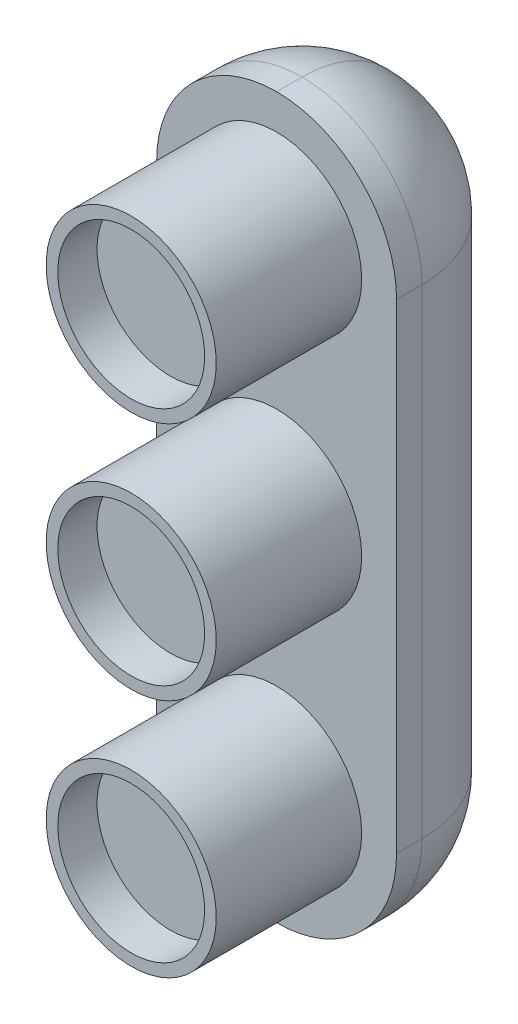
ISO-10303-21;
HEADER;
FILE_DESCRIPTION(('STEP AP214'),'2;1');
FILE_NAME('part.step','',(''),(''),'','','');
FILE_SCHEMA(('AUTOMOTIVE_DESIGN { 1 0 10303 214 1 1 1 1 }'));
ENDSEC;
DATA;
#1=APPLICATION_CONTEXT('core data for automotive mechanical design processes');
#2=APPLICATION_PROTOCOL_DEFINITION('international standard','automotive_design',2000,#1);
#3=PRODUCT_CONTEXT('',#1,'mechanical');
#4=PRODUCT('Part','Part','',(#3));
#5=PRODUCT_RELATED_PRODUCT_CATEGORY('part','',(#4));
#6=PRODUCT_DEFINITION_FORMATION('','',#4);
#7=PRODUCT_DEFINITION_CONTEXT('part definition',#1,'design');
#8=PRODUCT_DEFINITION('design','',#6,#7);
#9=PRODUCT_DEFINITION_SHAPE('','',#8);
#10=(LENGTH_UNIT() NAMED_UNIT(*) SI_UNIT(.MILLI.,.METRE.));
#11=(NAMED_UNIT(*) PLANE_ANGLE_UNIT() SI_UNIT($,.RADIAN.));
#12=(NAMED_UNIT(*) SI_UNIT($,.STERADIAN.) SOLID_ANGLE_UNIT());
#13=UNCERTAINTY_MEASURE_WITH_UNIT(LENGTH_MEASURE(1.E-05),#10,'distance_accuracy_value','');
#14=(GEOMETRIC_REPRESENTATION_CONTEXT(3) GLOBAL_UNCERTAINTY_ASSIGNED_CONTEXT((#13)) GLOBAL_UNIT_ASSIGNED_CONTEXT((#10,
#11,#12)) REPRESENTATION_CONTEXT('',''));
#15=CARTESIAN_POINT('',(0.,0.,0.));
#16=DIRECTION('',(0.,0.,1.));
#17=DIRECTION('',(1.,0.,0.));
#18=AXIS2_PLACEMENT_3D('',#15,#16,#17);
#19=CARTESIAN_POINT('',(-65.9999999999999,165.,20.));
#20=DIRECTION('',(1.,0.,0.));
#21=DIRECTION('',(0.,1.,0.));
#22=AXIS2_PLACEMENT_3D('',#19,#20,#21);
#23=PLANE('',#22);
#24=DIRECTION('',(0.,-1.,0.));
#25=VECTOR('',#24,1.);
#26=CARTESIAN_POINT('',(-65.9999999999999,165.,8.25));
#27=LINE('',#26,#25);
#28=CARTESIAN_POINT('',(-65.9999999999999,156.75,8.25));
#29=VERTEX_POINT('',#28);
#30=CARTESIAN_POINT('',(-65.9999999999999,123.75,8.25));
#31=VERTEX_POINT('',#30);
#32=EDGE_CURVE('E311',#29,#31,#27,.T.);
#33=ORIENTED_EDGE('',*,*,#32,.T.);
#34=DIRECTION('',(0.,0.,-1.));
#35=VECTOR('',#34,1.);
#36=CARTESIAN_POINT('',(-65.9999999999999,123.75,20.));
#37=LINE('',#36,#35);
#38=CARTESIAN_POINT('',(-65.9999999999999,123.75,10.));
#39=VERTEX_POINT('',#38);
#40=EDGE_CURVE('E184',#31,#39,#37,.F.);
#41=ORIENTED_EDGE('',*,*,#40,.T.);
#42=DIRECTION('',(0.,-1.,0.));
#43=VECTOR('',#42,1.);
#44=CARTESIAN_POINT('',(-66.,0.,10.));
#45=LINE('',#44,#43);
#46=CARTESIAN_POINT('',(-65.9999999999999,156.75,10.));
#47=VERTEX_POINT('',#46);
#48=EDGE_CURVE('E323',#47,#39,#45,.T.);
#49=ORIENTED_EDGE('',*,*,#48,.F.);
#50=DIRECTION('',(0.,0.,-1.));
#51=VECTOR('',#50,1.);
#52=CARTESIAN_POINT('',(-65.9999999999999,156.75,20.));
#53=LINE('',#52,#51);
#54=EDGE_CURVE('E309',#47,#29,#53,.T.);
#55=ORIENTED_EDGE('',*,*,#54,.T.);
#56=EDGE_LOOP('',(#33,#41,#49,#55));
#57=FACE_BOUND('',#56,.T.);
#58=ADVANCED_FACE('F84',(#57),#23,.F.);
#59=CARTESIAN_POINT('',(-49.5,165.,20.));
#60=DIRECTION('',(-1.,0.,0.));
#61=DIRECTION('',(0.,-1.,0.));
#62=AXIS2_PLACEMENT_3D('',#59,#60,#61);
#63=PLANE('',#62);
#64=DIRECTION('',(0.,1.,0.));
#65=VECTOR('',#64,1.);
#66=CARTESIAN_POINT('',(-49.4999999999999,0.,10.));
#67=LINE('',#66,#65);
#68=CARTESIAN_POINT('',(-49.5,123.75,10.));
#69=VERTEX_POINT('',#68);
#70=CARTESIAN_POINT('',(-49.5,156.75,10.));
#71=VERTEX_POINT('',#70);
#72=EDGE_CURVE('E161',#69,#71,#67,.T.);
#73=ORIENTED_EDGE('',*,*,#72,.F.);
#74=DIRECTION('',(0.,0.,-1.));
#75=VECTOR('',#74,1.);
#76=CARTESIAN_POINT('',(-49.4999999999999,123.75,20.));
#77=LINE('',#76,#75);
#78=CARTESIAN_POINT('',(-49.4999999999999,123.75,8.25));
#79=VERTEX_POINT('',#78);
#80=EDGE_CURVE('E156',#69,#79,#77,.T.);
#81=ORIENTED_EDGE('',*,*,#80,.T.);
#82=DIRECTION('',(0.,1.,0.));
#83=VECTOR('',#82,1.);
#84=CARTESIAN_POINT('',(-49.5,165.,8.25));
#85=LINE('',#84,#83);
#86=CARTESIAN_POINT('',(-49.5,156.75,8.25));
#87=VERTEX_POINT('',#86);
#88=EDGE_CURVE('E159',#79,#87,#85,.T.);
#89=ORIENTED_EDGE('',*,*,#88,.T.);
#90=DIRECTION('',(0.,0.,-1.));
#91=VECTOR('',#90,1.);
#92=CARTESIAN_POINT('',(-49.5,156.75,20.));
#93=LINE('',#92,#91);
#94=EDGE_CURVE('E181',#87,#71,#93,.F.);
#95=ORIENTED_EDGE('',*,*,#94,.T.);
#96=EDGE_LOOP('',(#73,#81,#89,#95));
#97=FACE_BOUND('',#96,.T.);
#98=ADVANCED_FACE('F157',(#97),#63,.F.);
#99=CARTESIAN_POINT('',(-57.7499999999999,156.75,10.));
#100=DIRECTION('',(0.,0.,1.));
#101=DIRECTION('',(1.,0.,0.));
#102=AXIS2_PLACEMENT_3D('',#99,#100,#101);
#103=CYLINDRICAL_SURFACE('',#102,5.85);
#104=CARTESIAN_POINT('',(-57.7499999999999,156.75,10.));
#105=DIRECTION('',(0.,0.,1.));
#106=DIRECTION('',(1.,0.,0.));
#107=AXIS2_PLACEMENT_3D('',#104,#105,#106);
#108=CIRCLE('',#107,5.85);
#109=CARTESIAN_POINT('',(-51.8999999999999,156.75,10.));
#110=VERTEX_POINT('',#109);
#111=EDGE_CURVE('E327',#110,#110,#108,.T.);
#112=ORIENTED_EDGE('',*,*,#111,.T.);
#113=EDGE_LOOP('',(#112));
#114=FACE_BOUND('',#113,.T.);
#115=CARTESIAN_POINT('',(-57.7499999999999,156.75,20.));
#116=DIRECTION('',(0.,0.,1.));
#117=DIRECTION('',(1.,0.,0.));
#118=AXIS2_PLACEMENT_3D('',#115,#116,#117);
#119=CIRCLE('',#118,5.85);
#120=CARTESIAN_POINT('',(-51.8999999999999,156.75,20.));
#121=VERTEX_POINT('',#120);
#122=EDGE_CURVE('E340',#121,#121,#119,.T.);
#123=ORIENTED_EDGE('',*,*,#122,.F.);
#124=EDGE_LOOP('',(#123));
#125=FACE_BOUND('',#124,.T.);
#126=ADVANCED_FACE('F262',(#114,#125),#103,.T.);
#127=CARTESIAN_POINT('',(-57.7499999999999,140.25,10.));
#128=DIRECTION('',(0.,0.,1.));
#129=DIRECTION('',(1.,0.,0.));
#130=AXIS2_PLACEMENT_3D('',#127,#128,#129);
#131=CYLINDRICAL_SURFACE('',#130,5.85);
#132=CARTESIAN_POINT('',(-57.7499999999999,140.25,10.));
#133=DIRECTION('',(0.,0.,1.));
#134=DIRECTION('',(1.,0.,0.));
#135=AXIS2_PLACEMENT_3D('',#132,#133,#134);
#136=CIRCLE('',#135,5.85);
#137=CARTESIAN_POINT('',(-51.8999999999999,140.25,10.));
#138=VERTEX_POINT('',#137);
#139=EDGE_CURVE('E333',#138,#138,#136,.T.);
#140=ORIENTED_EDGE('',*,*,#139,.T.);
#141=EDGE_LOOP('',(#140));
#142=FACE_BOUND('',#141,.T.);
#143=CARTESIAN_POINT('',(-57.7499999999999,140.25,20.));
#144=DIRECTION('',(0.,0.,1.));
#145=DIRECTION('',(1.,0.,0.));
#146=AXIS2_PLACEMENT_3D('',#143,#144,#145);
#147=CIRCLE('',#146,5.85);
#148=CARTESIAN_POINT('',(-51.8999999999999,140.25,20.));
#149=VERTEX_POINT('',#148);
#150=EDGE_CURVE('E337',#149,#149,#147,.T.);
#151=ORIENTED_EDGE('',*,*,#150,.F.);
#152=EDGE_LOOP('',(#151));
#153=FACE_BOUND('',#152,.T.);
#154=ADVANCED_FACE('F401',(#142,#153),#131,.T.);
#155=CARTESIAN_POINT('',(-57.7499999999999,123.75,10.));
#156=DIRECTION('',(0.,0.,1.));
#157=DIRECTION('',(1.,0.,0.));
#158=AXIS2_PLACEMENT_3D('',#155,#156,#157);
#159=CYLINDRICAL_SURFACE('',#158,5.85);
#160=CARTESIAN_POINT('',(-57.7499999999999,123.75,10.));
#161=DIRECTION('',(0.,0.,1.));
#162=DIRECTION('',(1.,0.,0.));
#163=AXIS2_PLACEMENT_3D('',#160,#161,#162);
#164=CIRCLE('',#163,5.85);
#165=CARTESIAN_POINT('',(-51.8999999999999,123.75,10.));
#166=VERTEX_POINT('',#165);
#167=EDGE_CURVE('E312',#166,#166,#164,.F.);
#168=ORIENTED_EDGE('',*,*,#167,.F.);
#169=EDGE_LOOP('',(#168));
#170=FACE_BOUND('',#169,.T.);
#171=CARTESIAN_POINT('',(-57.7499999999999,123.75,20.));
#172=DIRECTION('',(0.,0.,1.));
#173=DIRECTION('',(1.,0.,0.));
#174=AXIS2_PLACEMENT_3D('',#171,#172,#173);
#175=CIRCLE('',#174,5.85);
#176=CARTESIAN_POINT('',(-51.8999999999999,123.75,20.));
#177=VERTEX_POINT('',#176);
#178=EDGE_CURVE('E320',#177,#177,#175,.F.);
#179=ORIENTED_EDGE('',*,*,#178,.T.);
#180=EDGE_LOOP('',(#179));
#181=FACE_BOUND('',#180,.T.);
#182=ADVANCED_FACE('F397',(#170,#181),#159,.T.);
#183=CARTESIAN_POINT('',(0.,0.,10.));
#184=DIRECTION('',(0.,0.,1.));
#185=DIRECTION('',(1.,0.,0.));
#186=AXIS2_PLACEMENT_3D('',#183,#184,#185);
#187=PLANE('',#186);
#188=ORIENTED_EDGE('',*,*,#139,.F.);
#189=EDGE_LOOP('',(#188));
#190=FACE_BOUND('',#189,.T.);
#191=ORIENTED_EDGE('',*,*,#111,.F.);
#192=EDGE_LOOP('',(#191));
#193=FACE_BOUND('',#192,.T.);
#194=ORIENTED_EDGE('',*,*,#48,.T.);
#195=CARTESIAN_POINT('',(-57.75,123.75,10.));
#196=DIRECTION('',(0.,0.,1.));
#197=DIRECTION('',(1.,0.,0.));
#198=AXIS2_PLACEMENT_3D('',#195,#196,#197);
#199=CIRCLE('',#198,8.25);
#200=CARTESIAN_POINT('',(-57.75,115.5,10.));
#201=VERTEX_POINT('',#200);
#202=EDGE_CURVE('E94',#39,#201,#199,.T.);
#203=ORIENTED_EDGE('',*,*,#202,.T.);
#204=CARTESIAN_POINT('',(-57.7499999999999,123.75,10.));
#205=DIRECTION('',(0.,0.,1.));
#206=DIRECTION('',(1.,0.,0.));
#207=AXIS2_PLACEMENT_3D('',#204,#205,#206);
#208=CIRCLE('',#207,8.25);
#209=EDGE_CURVE('E192',#201,#69,#208,.T.);
#210=ORIENTED_EDGE('',*,*,#209,.T.);
#211=ORIENTED_EDGE('',*,*,#72,.T.);
#212=CARTESIAN_POINT('',(-57.75,156.75,10.));
#213=DIRECTION('',(0.,0.,1.));
#214=DIRECTION('',(1.,0.,0.));
#215=AXIS2_PLACEMENT_3D('',#212,#213,#214);
#216=CIRCLE('',#215,8.25);
#217=CARTESIAN_POINT('',(-57.7499999999999,165.,10.));
#218=VERTEX_POINT('',#217);
#219=EDGE_CURVE('E102',#71,#218,#216,.T.);
#220=ORIENTED_EDGE('',*,*,#219,.T.);
#221=CARTESIAN_POINT('',(-57.7499999999999,156.75,10.));
#222=DIRECTION('',(0.,0.,1.));
#223=DIRECTION('',(1.,0.,0.));
#224=AXIS2_PLACEMENT_3D('',#221,#222,#223);
#225=CIRCLE('',#224,8.25);
#226=EDGE_CURVE('E133',#218,#47,#225,.T.);
#227=ORIENTED_EDGE('',*,*,#226,.T.);
#228=EDGE_LOOP('',(#194,#203,#210,#211,#220,#227));
#229=FACE_BOUND('',#228,.T.);
#230=ORIENTED_EDGE('',*,*,#167,.T.);
#231=EDGE_LOOP('',(#230));
#232=FACE_BOUND('',#231,.T.);
#233=ADVANCED_FACE('F324',(#190,#193,#229,#232),#187,.T.);
#234=CARTESIAN_POINT('',(0.,0.,20.));
#235=DIRECTION('',(0.,0.,1.));
#236=DIRECTION('',(1.,0.,0.));
#237=AXIS2_PLACEMENT_3D('',#234,#235,#236);
#238=PLANE('',#237);
#239=ORIENTED_EDGE('',*,*,#150,.T.);
#240=EDGE_LOOP('',(#239));
#241=FACE_BOUND('',#240,.T.);
#242=CARTESIAN_POINT('',(-57.7499999999999,140.25,20.));
#243=DIRECTION('',(0.,0.,1.));
#244=DIRECTION('',(1.,0.,0.));
#245=AXIS2_PLACEMENT_3D('',#242,#243,#244);
#246=CIRCLE('',#245,5.05);
#247=CARTESIAN_POINT('',(-52.6999999999999,140.25,20.));
#248=VERTEX_POINT('',#247);
#249=EDGE_CURVE('E358',#248,#248,#246,.T.);
#250=ORIENTED_EDGE('',*,*,#249,.F.);
#251=EDGE_LOOP('',(#250));
#252=FACE_BOUND('',#251,.T.);
#253=ADVANCED_FACE('F370',(#241,#252),#238,.T.);
#254=ORIENTED_EDGE('',*,*,#122,.T.);
#255=EDGE_LOOP('',(#254));
#256=FACE_BOUND('',#255,.T.);
#257=CARTESIAN_POINT('',(-57.7499999999999,156.75,20.));
#258=DIRECTION('',(0.,0.,1.));
#259=DIRECTION('',(1.,0.,0.));
#260=AXIS2_PLACEMENT_3D('',#257,#258,#259);
#261=CIRCLE('',#260,5.05);
#262=CARTESIAN_POINT('',(-52.6999999999999,156.75,20.));
#263=VERTEX_POINT('',#262);
#264=EDGE_CURVE('E341',#263,#263,#261,.T.);
#265=ORIENTED_EDGE('',*,*,#264,.F.);
#266=EDGE_LOOP('',(#265));
#267=FACE_BOUND('',#266,.T.);
#268=ADVANCED_FACE('F368',(#256,#267),#238,.T.);
#269=CARTESIAN_POINT('',(-57.7499999999999,156.75,10.));
#270=DIRECTION('',(0.,0.,1.));
#271=DIRECTION('',(1.,0.,0.));
#272=AXIS2_PLACEMENT_3D('',#269,#270,#271);
#273=CYLINDRICAL_SURFACE('',#272,5.05);
#274=CARTESIAN_POINT('',(-57.7499999999999,156.75,17.3));
#275=DIRECTION('',(0.,0.,1.));
#276=DIRECTION('',(1.,0.,0.));
#277=AXIS2_PLACEMENT_3D('',#274,#275,#276);
#278=CIRCLE('',#277,5.05);
#279=CARTESIAN_POINT('',(-52.6999999999999,156.75,17.3));
#280=VERTEX_POINT('',#279);
#281=EDGE_CURVE('E202',#280,#280,#278,.F.);
#282=ORIENTED_EDGE('',*,*,#281,.T.);
#283=EDGE_LOOP('',(#282));
#284=FACE_BOUND('',#283,.T.);
#285=ORIENTED_EDGE('',*,*,#264,.T.);
#286=EDGE_LOOP('',(#285));
#287=FACE_BOUND('',#286,.T.);
#288=ADVANCED_FACE('F366',(#284,#287),#273,.F.);
#289=CARTESIAN_POINT('',(-57.7499999999999,140.25,10.));
#290=DIRECTION('',(0.,0.,1.));
#291=DIRECTION('',(1.,0.,0.));
#292=AXIS2_PLACEMENT_3D('',#289,#290,#291);
#293=CYLINDRICAL_SURFACE('',#292,5.05);
#294=CARTESIAN_POINT('',(-57.7499999999999,140.25,17.3));
#295=DIRECTION('',(0.,0.,1.));
#296=DIRECTION('',(1.,0.,0.));
#297=AXIS2_PLACEMENT_3D('',#294,#295,#296);
#298=CIRCLE('',#297,5.05);
#299=CARTESIAN_POINT('',(-52.6999999999999,140.25,17.3));
#300=VERTEX_POINT('',#299);
#301=EDGE_CURVE('E234',#300,#300,#298,.F.);
#302=ORIENTED_EDGE('',*,*,#301,.T.);
#303=EDGE_LOOP('',(#302));
#304=FACE_BOUND('',#303,.T.);
#305=ORIENTED_EDGE('',*,*,#249,.T.);
#306=EDGE_LOOP('',(#305));
#307=FACE_BOUND('',#306,.T.);
#308=ADVANCED_FACE('F239',(#304,#307),#293,.F.);
#309=CARTESIAN_POINT('',(-57.7499999999999,123.75,20.));
#310=DIRECTION('',(0.,0.,1.));
#311=DIRECTION('',(1.,0.,0.));
#312=AXIS2_PLACEMENT_3D('',#309,#310,#311);
#313=CIRCLE('',#312,5.05);
#314=CARTESIAN_POINT('',(-52.6999999999999,123.75,20.));
#315=VERTEX_POINT('',#314);
#316=EDGE_CURVE('E231',#315,#315,#313,.F.);
#317=ORIENTED_EDGE('',*,*,#316,.T.);
#318=EDGE_LOOP('',(#317));
#319=FACE_BOUND('',#318,.T.);
#320=ORIENTED_EDGE('',*,*,#178,.F.);
#321=EDGE_LOOP('',(#320));
#322=FACE_BOUND('',#321,.T.);
#323=ADVANCED_FACE('F371',(#319,#322),#238,.T.);
#324=CARTESIAN_POINT('',(-57.7499999999999,123.75,10.));
#325=DIRECTION('',(0.,0.,1.));
#326=DIRECTION('',(1.,0.,0.));
#327=AXIS2_PLACEMENT_3D('',#324,#325,#326);
#328=CYLINDRICAL_SURFACE('',#327,5.05);
#329=CARTESIAN_POINT('',(-57.7499999999999,123.75,17.3));
#330=DIRECTION('',(0.,0.,1.));
#331=DIRECTION('',(1.,0.,0.));
#332=AXIS2_PLACEMENT_3D('',#329,#330,#331);
#333=CIRCLE('',#332,5.05);
#334=CARTESIAN_POINT('',(-52.6999999999999,123.75,17.3));
#335=VERTEX_POINT('',#334);
#336=EDGE_CURVE('E12',#335,#335,#333,.T.);
#337=ORIENTED_EDGE('',*,*,#336,.F.);
#338=EDGE_LOOP('',(#337));
#339=FACE_BOUND('',#338,.T.);
#340=ORIENTED_EDGE('',*,*,#316,.F.);
#341=EDGE_LOOP('',(#340));
#342=FACE_BOUND('',#341,.T.);
#343=ADVANCED_FACE('F299',(#339,#342),#328,.F.);
#344=CARTESIAN_POINT('',(-57.7499999999999,123.75,20.));
#345=DIRECTION('',(0.,0.,-1.));
#346=DIRECTION('',(-1.,0.,0.));
#347=AXIS2_PLACEMENT_3D('',#344,#345,#346);
#348=CYLINDRICAL_SURFACE('',#347,8.25);
#349=ORIENTED_EDGE('',*,*,#80,.F.);
#350=ORIENTED_EDGE('',*,*,#209,.F.);
#351=DIRECTION('',(0.,0.,-1.));
#352=VECTOR('',#351,1.);
#353=CARTESIAN_POINT('',(-57.75,115.5,20.));
#354=LINE('',#353,#352);
#355=CARTESIAN_POINT('',(-57.75,115.5,8.25));
#356=VERTEX_POINT('',#355);
#357=EDGE_CURVE('E128',#356,#201,#354,.F.);
#358=ORIENTED_EDGE('',*,*,#357,.F.);
#359=CARTESIAN_POINT('',(-57.7499999999999,123.75,8.25));
#360=DIRECTION('',(0.,0.,-1.));
#361=DIRECTION('',(-1.,0.,0.));
#362=AXIS2_PLACEMENT_3D('',#359,#360,#361);
#363=CIRCLE('',#362,8.25);
#364=EDGE_CURVE('E164',#79,#356,#363,.T.);
#365=ORIENTED_EDGE('',*,*,#364,.F.);
#366=EDGE_LOOP('',(#349,#350,#358,#365));
#367=FACE_BOUND('',#366,.T.);
#368=ADVANCED_FACE('F86',(#367),#348,.T.);
#369=CARTESIAN_POINT('',(-57.75,123.75,20.));
#370=DIRECTION('',(0.,0.,-1.));
#371=DIRECTION('',(-1.,0.,0.));
#372=AXIS2_PLACEMENT_3D('',#369,#370,#371);
#373=CYLINDRICAL_SURFACE('',#372,8.25);
#374=CARTESIAN_POINT('',(-57.75,123.75,8.25));
#375=DIRECTION('',(0.,0.,-1.));
#376=DIRECTION('',(-1.,0.,0.));
#377=AXIS2_PLACEMENT_3D('',#374,#375,#376);
#378=CIRCLE('',#377,8.25);
#379=EDGE_CURVE('E166',#356,#31,#378,.T.);
#380=ORIENTED_EDGE('',*,*,#379,.F.);
#381=ORIENTED_EDGE('',*,*,#357,.T.);
#382=ORIENTED_EDGE('',*,*,#202,.F.);
#383=ORIENTED_EDGE('',*,*,#40,.F.);
#384=EDGE_LOOP('',(#380,#381,#382,#383));
#385=FACE_BOUND('',#384,.T.);
#386=ADVANCED_FACE('F293',(#385),#373,.T.);
#387=CARTESIAN_POINT('',(-57.7499999999999,123.75,8.25));
#388=DIRECTION('',(0.,-1.,0.));
#389=DIRECTION('',(1.,0.,0.));
#390=AXIS2_PLACEMENT_3D('',#387,#388,#389);
#391=SPHERICAL_SURFACE('',#390,8.25);
#392=ORIENTED_EDGE('',*,*,#364,.T.);
#393=CARTESIAN_POINT('',(-57.75,123.75,8.25));
#394=DIRECTION('',(-1.,0.,0.));
#395=DIRECTION('',(0.,-1.,0.));
#396=AXIS2_PLACEMENT_3D('',#393,#394,#395);
#397=CIRCLE('',#396,8.25);
#398=CARTESIAN_POINT('',(-57.75,123.75,0.));
#399=VERTEX_POINT('',#398);
#400=EDGE_CURVE('E120',#399,#356,#397,.T.);
#401=ORIENTED_EDGE('',*,*,#400,.F.);
#402=CARTESIAN_POINT('',(-57.7499999999999,123.75,8.25));
#403=DIRECTION('',(0.,-1.,0.));
#404=DIRECTION('',(0.,0.,-1.));
#405=AXIS2_PLACEMENT_3D('',#402,#403,#404);
#406=CIRCLE('',#405,8.25);
#407=EDGE_CURVE('E168',#79,#399,#406,.F.);
#408=ORIENTED_EDGE('',*,*,#407,.F.);
#409=EDGE_LOOP('',(#392,#401,#408));
#410=FACE_BOUND('',#409,.T.);
#411=ADVANCED_FACE('F169',(#410),#391,.T.);
#412=CARTESIAN_POINT('',(-57.75,123.75,8.25));
#413=DIRECTION('',(0.,-1.,0.));
#414=DIRECTION('',(1.,0.,0.));
#415=AXIS2_PLACEMENT_3D('',#412,#413,#414);
#416=SPHERICAL_SURFACE('',#415,8.25);
#417=ORIENTED_EDGE('',*,*,#400,.T.);
#418=ORIENTED_EDGE('',*,*,#379,.T.);
#419=CARTESIAN_POINT('',(-57.75,123.75,8.25));
#420=DIRECTION('',(0.,-1.,0.));
#421=DIRECTION('',(0.,0.,-1.));
#422=AXIS2_PLACEMENT_3D('',#419,#420,#421);
#423=CIRCLE('',#422,8.25);
#424=EDGE_CURVE('E219',#399,#31,#423,.F.);
#425=ORIENTED_EDGE('',*,*,#424,.F.);
#426=EDGE_LOOP('',(#417,#418,#425));
#427=FACE_BOUND('',#426,.T.);
#428=ADVANCED_FACE('F288',(#427),#416,.T.);
#429=CARTESIAN_POINT('',(-57.75,165.,8.25));
#430=DIRECTION('',(0.,1.,0.));
#431=DIRECTION('',(-1.,0.,0.));
#432=AXIS2_PLACEMENT_3D('',#429,#430,#431);
#433=CYLINDRICAL_SURFACE('',#432,8.25);
#434=ORIENTED_EDGE('',*,*,#88,.F.);
#435=ORIENTED_EDGE('',*,*,#407,.T.);
#436=DIRECTION('',(0.,1.,0.));
#437=VECTOR('',#436,1.);
#438=CARTESIAN_POINT('',(-57.7499999999999,0.,0.));
#439=LINE('',#438,#437);
#440=CARTESIAN_POINT('',(-57.75,156.75,0.));
#441=VERTEX_POINT('',#440);
#442=EDGE_CURVE('E215',#441,#399,#439,.F.);
#443=ORIENTED_EDGE('',*,*,#442,.F.);
#444=CARTESIAN_POINT('',(-57.75,156.75,8.25));
#445=DIRECTION('',(0.,1.,0.));
#446=DIRECTION('',(0.,0.,1.));
#447=AXIS2_PLACEMENT_3D('',#444,#445,#446);
#448=CIRCLE('',#447,8.25);
#449=EDGE_CURVE('E178',#87,#441,#448,.T.);
#450=ORIENTED_EDGE('',*,*,#449,.F.);
#451=EDGE_LOOP('',(#434,#435,#443,#450));
#452=FACE_BOUND('',#451,.T.);
#453=ADVANCED_FACE('F176',(#452),#433,.T.);
#454=CARTESIAN_POINT('',(-57.75,156.75,20.));
#455=DIRECTION('',(0.,0.,-1.));
#456=DIRECTION('',(-1.,0.,0.));
#457=AXIS2_PLACEMENT_3D('',#454,#455,#456);
#458=CYLINDRICAL_SURFACE('',#457,8.25);
#459=DIRECTION('',(0.,0.,-1.));
#460=VECTOR('',#459,1.);
#461=CARTESIAN_POINT('',(-57.7499999999999,165.,20.));
#462=LINE('',#461,#460);
#463=CARTESIAN_POINT('',(-57.7499999999999,165.,8.25));
#464=VERTEX_POINT('',#463);
#465=EDGE_CURVE('E173',#218,#464,#462,.T.);
#466=ORIENTED_EDGE('',*,*,#465,.F.);
#467=ORIENTED_EDGE('',*,*,#219,.F.);
#468=ORIENTED_EDGE('',*,*,#94,.F.);
#469=CARTESIAN_POINT('',(-57.75,156.75,8.25));
#470=DIRECTION('',(0.,0.,-1.));
#471=DIRECTION('',(-1.,0.,0.));
#472=AXIS2_PLACEMENT_3D('',#469,#470,#471);
#473=CIRCLE('',#472,8.25);
#474=EDGE_CURVE('E210',#464,#87,#473,.T.);
#475=ORIENTED_EDGE('',*,*,#474,.F.);
#476=EDGE_LOOP('',(#466,#467,#468,#475));
#477=FACE_BOUND('',#476,.T.);
#478=ADVANCED_FACE('F281',(#477),#458,.T.);
#479=CARTESIAN_POINT('',(-57.7499999999999,156.75,20.));
#480=DIRECTION('',(0.,0.,-1.));
#481=DIRECTION('',(-1.,0.,0.));
#482=AXIS2_PLACEMENT_3D('',#479,#480,#481);
#483=CYLINDRICAL_SURFACE('',#482,8.25);
#484=ORIENTED_EDGE('',*,*,#226,.F.);
#485=ORIENTED_EDGE('',*,*,#465,.T.);
#486=CARTESIAN_POINT('',(-57.7499999999999,156.75,8.25));
#487=DIRECTION('',(0.,0.,-1.));
#488=DIRECTION('',(-1.,0.,0.));
#489=AXIS2_PLACEMENT_3D('',#486,#487,#488);
#490=CIRCLE('',#489,8.25);
#491=EDGE_CURVE('E206',#29,#464,#490,.T.);
#492=ORIENTED_EDGE('',*,*,#491,.F.);
#493=ORIENTED_EDGE('',*,*,#54,.F.);
#494=EDGE_LOOP('',(#484,#485,#492,#493));
#495=FACE_BOUND('',#494,.T.);
#496=ADVANCED_FACE('F277',(#495),#483,.T.);
#497=CARTESIAN_POINT('',(-57.7499999999999,165.,8.25));
#498=DIRECTION('',(0.,-1.,0.));
#499=DIRECTION('',(1.,0.,0.));
#500=AXIS2_PLACEMENT_3D('',#497,#498,#499);
#501=CYLINDRICAL_SURFACE('',#500,8.25);
#502=ORIENTED_EDGE('',*,*,#424,.T.);
#503=ORIENTED_EDGE('',*,*,#32,.F.);
#504=CARTESIAN_POINT('',(-57.7499999999999,156.75,8.25));
#505=DIRECTION('',(0.,1.,0.));
#506=DIRECTION('',(0.,0.,1.));
#507=AXIS2_PLACEMENT_3D('',#504,#505,#506);
#508=CIRCLE('',#507,8.25);
#509=EDGE_CURVE('E201',#441,#29,#508,.T.);
#510=ORIENTED_EDGE('',*,*,#509,.F.);
#511=ORIENTED_EDGE('',*,*,#442,.T.);
#512=EDGE_LOOP('',(#502,#503,#510,#511));
#513=FACE_BOUND('',#512,.T.);
#514=ADVANCED_FACE('F273',(#513),#501,.T.);
#515=CARTESIAN_POINT('',(-57.75,156.75,8.25));
#516=DIRECTION('',(1.,0.,0.));
#517=DIRECTION('',(0.,0.,-1.));
#518=AXIS2_PLACEMENT_3D('',#515,#516,#517);
#519=SPHERICAL_SURFACE('',#518,8.25);
#520=ORIENTED_EDGE('',*,*,#474,.T.);
#521=ORIENTED_EDGE('',*,*,#449,.T.);
#522=CARTESIAN_POINT('',(-57.75,156.75,8.25));
#523=DIRECTION('',(1.,0.,0.));
#524=DIRECTION('',(0.,1.,0.));
#525=AXIS2_PLACEMENT_3D('',#522,#523,#524);
#526=CIRCLE('',#525,8.25);
#527=EDGE_CURVE('E197',#464,#441,#526,.F.);
#528=ORIENTED_EDGE('',*,*,#527,.F.);
#529=EDGE_LOOP('',(#520,#521,#528));
#530=FACE_BOUND('',#529,.T.);
#531=ADVANCED_FACE('F269',(#530),#519,.T.);
#532=CARTESIAN_POINT('',(-57.7499999999999,156.75,8.25));
#533=DIRECTION('',(-1.,0.,0.));
#534=DIRECTION('',(0.,0.,1.));
#535=AXIS2_PLACEMENT_3D('',#532,#533,#534);
#536=SPHERICAL_SURFACE('',#535,8.25);
#537=ORIENTED_EDGE('',*,*,#509,.T.);
#538=ORIENTED_EDGE('',*,*,#491,.T.);
#539=ORIENTED_EDGE('',*,*,#527,.T.);
#540=EDGE_LOOP('',(#537,#538,#539));
#541=FACE_BOUND('',#540,.T.);
#542=ADVANCED_FACE('F253',(#541),#536,.T.);
#543=CARTESIAN_POINT('',(-57.7499999999999,156.75,17.3));
#544=DIRECTION('',(0.,0.,1.));
#545=DIRECTION('',(1.,0.,0.));
#546=AXIS2_PLACEMENT_3D('',#543,#544,#545);
#547=PLANE('',#546);
#548=ORIENTED_EDGE('',*,*,#281,.F.);
#549=EDGE_LOOP('',(#548));
#550=FACE_BOUND('',#549,.T.);
#551=ADVANCED_FACE('F245',(#550),#547,.T.);
#552=CARTESIAN_POINT('',(-57.7499999999999,140.25,17.3));
#553=DIRECTION('',(0.,0.,1.));
#554=DIRECTION('',(1.,0.,0.));
#555=AXIS2_PLACEMENT_3D('',#552,#553,#554);
#556=PLANE('',#555);
#557=ORIENTED_EDGE('',*,*,#301,.F.);
#558=EDGE_LOOP('',(#557));
#559=FACE_BOUND('',#558,.T.);
#560=ADVANCED_FACE('F242',(#559),#556,.T.);
#561=CARTESIAN_POINT('',(-57.7499999999999,123.75,17.3));
#562=DIRECTION('',(0.,0.,1.));
#563=DIRECTION('',(1.,0.,0.));
#564=AXIS2_PLACEMENT_3D('',#561,#562,#563);
#565=PLANE('',#564);
#566=ORIENTED_EDGE('',*,*,#336,.T.);
#567=EDGE_LOOP('',(#566));
#568=FACE_BOUND('',#567,.T.);
#569=ADVANCED_FACE('F244',(#568),#565,.T.);
#570=CLOSED_SHELL('',(#58,#98,#126,#154,#182,#233,#253,#268,#288,#308,#323,#343,#368,#386,#411,
#428,#453,#478,#496,#514,#531,#542,#551,#560,#569));
#571=MANIFOLD_SOLID_BREP('B2',#570);
#572=ADVANCED_BREP_SHAPE_REPRESENTATION('',(#18,#571),#14);
#573=SHAPE_DEFINITION_REPRESENTATION(#9,#572);
ENDSEC;
END-ISO-10303-21;
